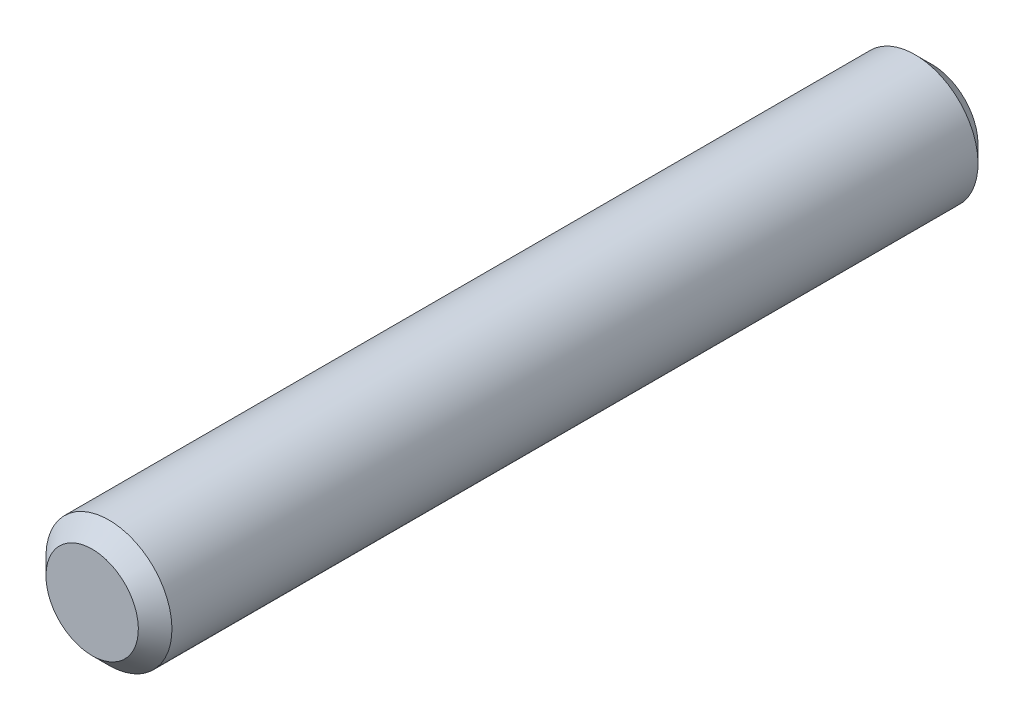
ISO-10303-21;
HEADER;
FILE_DESCRIPTION(('STEP AP214'),'2;1');
FILE_NAME('part.step','',(''),(''),'','','');
FILE_SCHEMA(('AUTOMOTIVE_DESIGN { 1 0 10303 214 1 1 1 1 }'));
ENDSEC;
DATA;
#1=APPLICATION_CONTEXT('core data for automotive mechanical design processes');
#2=APPLICATION_PROTOCOL_DEFINITION('international standard','automotive_design',2000,#1);
#3=PRODUCT_CONTEXT('',#1,'mechanical');
#4=PRODUCT('Part','Part','',(#3));
#5=PRODUCT_RELATED_PRODUCT_CATEGORY('part','',(#4));
#6=PRODUCT_DEFINITION_FORMATION('','',#4);
#7=PRODUCT_DEFINITION_CONTEXT('part definition',#1,'design');
#8=PRODUCT_DEFINITION('design','',#6,#7);
#9=PRODUCT_DEFINITION_SHAPE('','',#8);
#10=(LENGTH_UNIT() NAMED_UNIT(*) SI_UNIT(.MILLI.,.METRE.));
#11=(NAMED_UNIT(*) PLANE_ANGLE_UNIT() SI_UNIT($,.RADIAN.));
#12=(NAMED_UNIT(*) SI_UNIT($,.STERADIAN.) SOLID_ANGLE_UNIT());
#13=UNCERTAINTY_MEASURE_WITH_UNIT(LENGTH_MEASURE(1.E-05),#10,'distance_accuracy_value','');
#14=(GEOMETRIC_REPRESENTATION_CONTEXT(3) GLOBAL_UNCERTAINTY_ASSIGNED_CONTEXT((#13)) GLOBAL_UNIT_ASSIGNED_CONTEXT((#10,
#11,#12)) REPRESENTATION_CONTEXT('',''));
#15=CARTESIAN_POINT('',(0.,0.,0.));
#16=DIRECTION('',(0.,0.,1.));
#17=DIRECTION('',(1.,0.,0.));
#18=AXIS2_PLACEMENT_3D('',#15,#16,#17);
#19=CARTESIAN_POINT('',(0.,0.,5.));
#20=DIRECTION('',(0.,0.,-1.));
#21=DIRECTION('',(0.,1.,0.));
#22=AXIS2_PLACEMENT_3D('',#19,#20,#21);
#23=CYLINDRICAL_SURFACE('',#22,0.75);
#24=CARTESIAN_POINT('',(0.,0.,-4.8));
#25=DIRECTION('',(0.,0.,1.));
#26=DIRECTION('',(0.,-1.,0.));
#27=AXIS2_PLACEMENT_3D('',#24,#25,#26);
#28=CIRCLE('',#27,0.75);
#29=CARTESIAN_POINT('',(0.,-0.75,-4.8));
#30=VERTEX_POINT('',#29);
#31=EDGE_CURVE('E10',#30,#30,#28,.T.);
#32=ORIENTED_EDGE('',*,*,#31,.T.);
#33=EDGE_LOOP('',(#32));
#34=FACE_BOUND('',#33,.T.);
#35=CARTESIAN_POINT('',(0.,0.,4.8));
#36=DIRECTION('',(0.,0.,1.));
#37=DIRECTION('',(0.,-1.,0.));
#38=AXIS2_PLACEMENT_3D('',#35,#36,#37);
#39=CIRCLE('',#38,0.75);
#40=CARTESIAN_POINT('',(0.,-0.75,4.8));
#41=VERTEX_POINT('',#40);
#42=EDGE_CURVE('E22',#41,#41,#39,.F.);
#43=ORIENTED_EDGE('',*,*,#42,.T.);
#44=EDGE_LOOP('',(#43));
#45=FACE_BOUND('',#44,.T.);
#46=ADVANCED_FACE('F15',(#34,#45),#23,.T.);
#47=CARTESIAN_POINT('',(0.,0.,5.));
#48=DIRECTION('',(0.,0.,1.));
#49=DIRECTION('',(0.,-1.,0.));
#50=AXIS2_PLACEMENT_3D('',#47,#48,#49);
#51=PLANE('',#50);
#52=CARTESIAN_POINT('',(0.,0.,5.));
#53=DIRECTION('',(0.,0.,1.));
#54=DIRECTION('',(0.,-1.,0.));
#55=AXIS2_PLACEMENT_3D('',#52,#53,#54);
#56=CIRCLE('',#55,0.55);
#57=CARTESIAN_POINT('',(0.,-0.55,5.));
#58=VERTEX_POINT('',#57);
#59=EDGE_CURVE('E29',#58,#58,#56,.T.);
#60=ORIENTED_EDGE('',*,*,#59,.T.);
#61=EDGE_LOOP('',(#60));
#62=FACE_BOUND('',#61,.T.);
#63=ADVANCED_FACE('F58',(#62),#51,.T.);
#64=CARTESIAN_POINT('',(0.,0.,-5.));
#65=DIRECTION('',(0.,0.,1.));
#66=DIRECTION('',(0.,-1.,0.));
#67=AXIS2_PLACEMENT_3D('',#64,#65,#66);
#68=PLANE('',#67);
#69=CARTESIAN_POINT('',(0.,0.,-5.));
#70=DIRECTION('',(0.,0.,1.));
#71=DIRECTION('',(0.,-1.,0.));
#72=AXIS2_PLACEMENT_3D('',#69,#70,#71);
#73=CIRCLE('',#72,0.55);
#74=CARTESIAN_POINT('',(0.,-0.55,-5.));
#75=VERTEX_POINT('',#74);
#76=EDGE_CURVE('E35',#75,#75,#73,.F.);
#77=ORIENTED_EDGE('',*,*,#76,.T.);
#78=EDGE_LOOP('',(#77));
#79=FACE_BOUND('',#78,.T.);
#80=ADVANCED_FACE('F44',(#79),#68,.F.);
#81=CARTESIAN_POINT('',(0.,0.,-4.8));
#82=DIRECTION('',(0.,0.,1.));
#83=DIRECTION('',(0.,-1.,0.));
#84=AXIS2_PLACEMENT_3D('',#81,#82,#83);
#85=CONICAL_SURFACE('',#84,0.75,0.785398163397449);
#86=ORIENTED_EDGE('',*,*,#76,.F.);
#87=EDGE_LOOP('',(#86));
#88=FACE_BOUND('',#87,.T.);
#89=ORIENTED_EDGE('',*,*,#31,.F.);
#90=EDGE_LOOP('',(#89));
#91=FACE_BOUND('',#90,.T.);
#92=ADVANCED_FACE('F46',(#88,#91),#85,.T.);
#93=CARTESIAN_POINT('',(0.,0.,5.));
#94=DIRECTION('',(0.,0.,-1.));
#95=DIRECTION('',(0.,1.,0.));
#96=AXIS2_PLACEMENT_3D('',#93,#94,#95);
#97=CONICAL_SURFACE('',#96,0.55,0.785398163397447);
#98=ORIENTED_EDGE('',*,*,#42,.F.);
#99=EDGE_LOOP('',(#98));
#100=FACE_BOUND('',#99,.T.);
#101=ORIENTED_EDGE('',*,*,#59,.F.);
#102=EDGE_LOOP('',(#101));
#103=FACE_BOUND('',#102,.T.);
#104=ADVANCED_FACE('F49',(#100,#103),#97,.T.);
#105=CLOSED_SHELL('',(#46,#63,#80,#92,#104));
#106=MANIFOLD_SOLID_BREP('B1',#105);
#107=ADVANCED_BREP_SHAPE_REPRESENTATION('',(#18,#106),#14);
#108=SHAPE_DEFINITION_REPRESENTATION(#9,#107);
ENDSEC;
END-ISO-10303-21;
